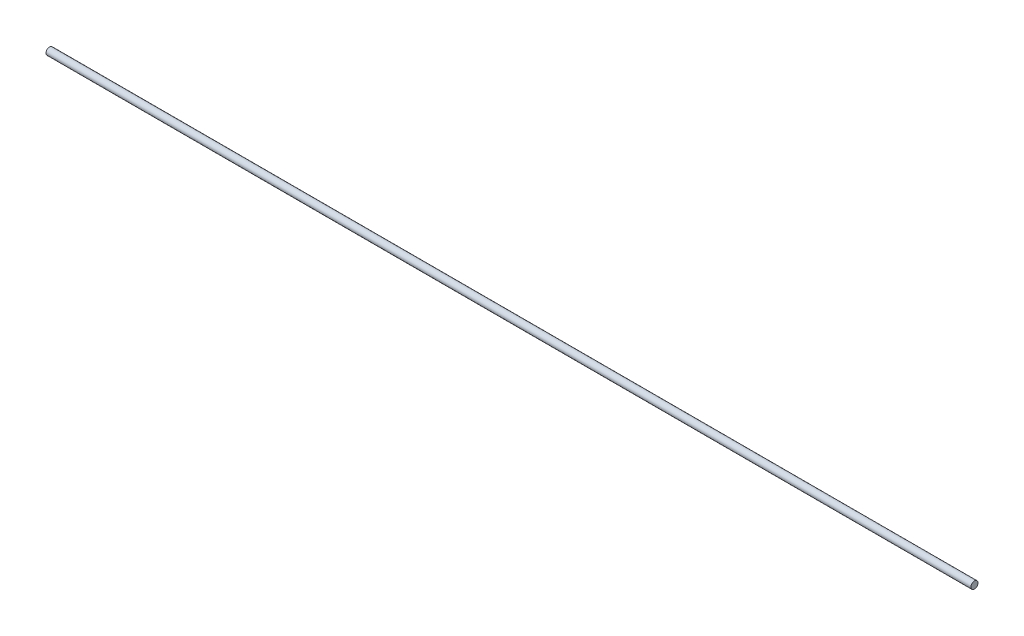
ISO-10303-21;
HEADER;
FILE_DESCRIPTION(('STEP AP214'),'2;1');
FILE_NAME('part.step','',(''),(''),'','','');
FILE_SCHEMA(('AUTOMOTIVE_DESIGN { 1 0 10303 214 1 1 1 1 }'));
ENDSEC;
DATA;
#1=APPLICATION_CONTEXT('core data for automotive mechanical design processes');
#2=APPLICATION_PROTOCOL_DEFINITION('international standard','automotive_design',2000,#1);
#3=PRODUCT_CONTEXT('',#1,'mechanical');
#4=PRODUCT('Part','Part','',(#3));
#5=PRODUCT_RELATED_PRODUCT_CATEGORY('part','',(#4));
#6=PRODUCT_DEFINITION_FORMATION('','',#4);
#7=PRODUCT_DEFINITION_CONTEXT('part definition',#1,'design');
#8=PRODUCT_DEFINITION('design','',#6,#7);
#9=PRODUCT_DEFINITION_SHAPE('','',#8);
#10=(LENGTH_UNIT() NAMED_UNIT(*) SI_UNIT(.MILLI.,.METRE.));
#11=(NAMED_UNIT(*) PLANE_ANGLE_UNIT() SI_UNIT($,.RADIAN.));
#12=(NAMED_UNIT(*) SI_UNIT($,.STERADIAN.) SOLID_ANGLE_UNIT());
#13=UNCERTAINTY_MEASURE_WITH_UNIT(LENGTH_MEASURE(1.E-05),#10,'distance_accuracy_value','');
#14=(GEOMETRIC_REPRESENTATION_CONTEXT(3) GLOBAL_UNCERTAINTY_ASSIGNED_CONTEXT((#13)) GLOBAL_UNIT_ASSIGNED_CONTEXT((#10,
#11,#12)) REPRESENTATION_CONTEXT('',''));
#15=CARTESIAN_POINT('',(0.,0.,0.));
#16=DIRECTION('',(0.,0.,1.));
#17=DIRECTION('',(1.,0.,0.));
#18=AXIS2_PLACEMENT_3D('',#15,#16,#17);
#19=CARTESIAN_POINT('',(518.467184468495,2.49134831028641,-0.958127897661143));
#20=DIRECTION('',(-1.,0.,0.));
#21=DIRECTION('',(0.,0.,1.));
#22=AXIS2_PLACEMENT_3D('',#19,#20,#21);
#23=CYLINDRICAL_SURFACE('',#22,4.);
#24=CARTESIAN_POINT('',(518.467184468495,2.49134831028641,-0.958127897661143));
#25=DIRECTION('',(1.,0.,0.));
#26=DIRECTION('',(0.,0.,-1.));
#27=AXIS2_PLACEMENT_3D('',#24,#25,#26);
#28=CIRCLE('',#27,4.);
#29=CARTESIAN_POINT('',(518.467184468495,2.49134831028641,-4.95812789766114));
#30=VERTEX_POINT('',#29);
#31=EDGE_CURVE('E8',#30,#30,#28,.T.);
#32=ORIENTED_EDGE('',*,*,#31,.F.);
#33=EDGE_LOOP('',(#32));
#34=FACE_BOUND('',#33,.T.);
#35=CARTESIAN_POINT('',(-521.532815531505,2.49134831028641,-0.958127897661143));
#36=DIRECTION('',(1.,0.,0.));
#37=DIRECTION('',(0.,0.,-1.));
#38=AXIS2_PLACEMENT_3D('',#35,#36,#37);
#39=CIRCLE('',#38,4.);
#40=CARTESIAN_POINT('',(-521.532815531505,2.49134831028641,-4.95812789766114));
#41=VERTEX_POINT('',#40);
#42=EDGE_CURVE('E16',#41,#41,#39,.T.);
#43=ORIENTED_EDGE('',*,*,#42,.T.);
#44=EDGE_LOOP('',(#43));
#45=FACE_BOUND('',#44,.T.);
#46=ADVANCED_FACE('F13',(#34,#45),#23,.T.);
#47=CARTESIAN_POINT('',(518.467184468495,2.49134831028641,-0.958127897661143));
#48=DIRECTION('',(1.,0.,0.));
#49=DIRECTION('',(0.,0.,-1.));
#50=AXIS2_PLACEMENT_3D('',#47,#48,#49);
#51=PLANE('',#50);
#52=ORIENTED_EDGE('',*,*,#31,.T.);
#53=EDGE_LOOP('',(#52));
#54=FACE_BOUND('',#53,.T.);
#55=ADVANCED_FACE('F28',(#54),#51,.T.);
#56=CARTESIAN_POINT('',(-521.532815531505,2.49134831028641,-0.958127897661143));
#57=DIRECTION('',(1.,0.,0.));
#58=DIRECTION('',(0.,0.,-1.));
#59=AXIS2_PLACEMENT_3D('',#56,#57,#58);
#60=PLANE('',#59);
#61=ORIENTED_EDGE('',*,*,#42,.F.);
#62=EDGE_LOOP('',(#61));
#63=FACE_BOUND('',#62,.T.);
#64=ADVANCED_FACE('F26',(#63),#60,.F.);
#65=CLOSED_SHELL('',(#46,#55,#64));
#66=MANIFOLD_SOLID_BREP('B1',#65);
#67=ADVANCED_BREP_SHAPE_REPRESENTATION('',(#18,#66),#14);
#68=SHAPE_DEFINITION_REPRESENTATION(#9,#67);
ENDSEC;
END-ISO-10303-21;
